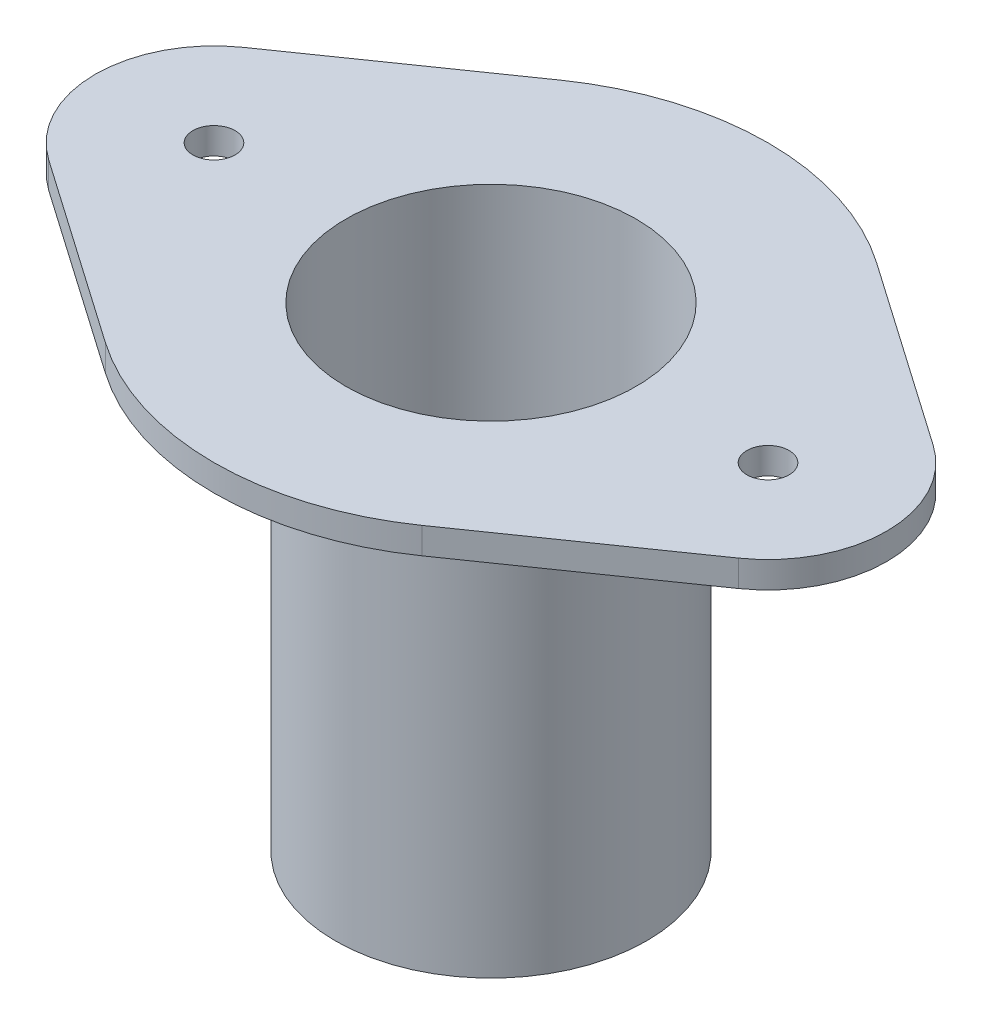
ISO-10303-21;
HEADER;
FILE_DESCRIPTION(('STEP AP214'),'2;1');
FILE_NAME('part.step','',(''),(''),'','','');
FILE_SCHEMA(('AUTOMOTIVE_DESIGN { 1 0 10303 214 1 1 1 1 }'));
ENDSEC;
DATA;
#1=APPLICATION_CONTEXT('core data for automotive mechanical design processes');
#2=APPLICATION_PROTOCOL_DEFINITION('international standard','automotive_design',2000,#1);
#3=PRODUCT_CONTEXT('',#1,'mechanical');
#4=PRODUCT('Part','Part','',(#3));
#5=PRODUCT_RELATED_PRODUCT_CATEGORY('part','',(#4));
#6=PRODUCT_DEFINITION_FORMATION('','',#4);
#7=PRODUCT_DEFINITION_CONTEXT('part definition',#1,'design');
#8=PRODUCT_DEFINITION('design','',#6,#7);
#9=PRODUCT_DEFINITION_SHAPE('','',#8);
#10=(LENGTH_UNIT() NAMED_UNIT(*) SI_UNIT(.MILLI.,.METRE.));
#11=(NAMED_UNIT(*) PLANE_ANGLE_UNIT() SI_UNIT($,.RADIAN.));
#12=(NAMED_UNIT(*) SI_UNIT($,.STERADIAN.) SOLID_ANGLE_UNIT());
#13=UNCERTAINTY_MEASURE_WITH_UNIT(LENGTH_MEASURE(1.E-05),#10,'distance_accuracy_value','');
#14=(GEOMETRIC_REPRESENTATION_CONTEXT(3) GLOBAL_UNCERTAINTY_ASSIGNED_CONTEXT((#13)) GLOBAL_UNIT_ASSIGNED_CONTEXT((#10,
#11,#12)) REPRESENTATION_CONTEXT('',''));
#15=CARTESIAN_POINT('',(0.,0.,0.));
#16=DIRECTION('',(0.,0.,1.));
#17=DIRECTION('',(1.,0.,0.));
#18=AXIS2_PLACEMENT_3D('',#15,#16,#17);
#19=CARTESIAN_POINT('',(0.,0.,0.));
#20=DIRECTION('',(0.,1.,0.));
#21=DIRECTION('',(0.,0.,1.));
#22=AXIS2_PLACEMENT_3D('',#19,#20,#21);
#23=PLANE('',#22);
#24=CARTESIAN_POINT('',(0.,0.,0.));
#25=DIRECTION('',(0.,1.,0.));
#26=DIRECTION('',(0.,0.,1.));
#27=AXIS2_PLACEMENT_3D('',#24,#25,#26);
#28=CIRCLE('',#27,29.5);
#29=CARTESIAN_POINT('',(0.,0.,29.5));
#30=VERTEX_POINT('',#29);
#31=EDGE_CURVE('E37',#30,#30,#28,.T.);
#32=ORIENTED_EDGE('',*,*,#31,.F.);
#33=EDGE_LOOP('',(#32));
#34=FACE_BOUND('',#33,.T.);
#35=CARTESIAN_POINT('',(0.,0.,0.));
#36=DIRECTION('',(0.,1.,0.));
#37=DIRECTION('',(0.,0.,1.));
#38=AXIS2_PLACEMENT_3D('',#35,#36,#37);
#39=CIRCLE('',#38,27.5);
#40=CARTESIAN_POINT('',(0.,0.,27.5));
#41=VERTEX_POINT('',#40);
#42=EDGE_CURVE('E162',#41,#41,#39,.T.);
#43=ORIENTED_EDGE('',*,*,#42,.T.);
#44=EDGE_LOOP('',(#43));
#45=FACE_BOUND('',#44,.T.);
#46=ADVANCED_FACE('F33',(#34,#45),#23,.F.);
#47=CARTESIAN_POINT('',(0.,85.,0.));
#48=DIRECTION('',(0.,-1.,0.));
#49=DIRECTION('',(0.,0.,-1.));
#50=AXIS2_PLACEMENT_3D('',#47,#48,#49);
#51=CYLINDRICAL_SURFACE('',#50,29.5);
#52=CARTESIAN_POINT('',(0.,85.,0.));
#53=DIRECTION('',(0.,1.,0.));
#54=DIRECTION('',(0.,0.,1.));
#55=AXIS2_PLACEMENT_3D('',#52,#53,#54);
#56=CIRCLE('',#55,29.5);
#57=CARTESIAN_POINT('',(0.,85.,29.5));
#58=VERTEX_POINT('',#57);
#59=EDGE_CURVE('E11',#58,#58,#56,.T.);
#60=ORIENTED_EDGE('',*,*,#59,.F.);
#61=EDGE_LOOP('',(#60));
#62=FACE_BOUND('',#61,.T.);
#63=ORIENTED_EDGE('',*,*,#31,.T.);
#64=EDGE_LOOP('',(#63));
#65=FACE_BOUND('',#64,.T.);
#66=ADVANCED_FACE('F35',(#62,#65),#51,.T.);
#67=CARTESIAN_POINT('',(0.,85.,0.));
#68=DIRECTION('',(0.,-1.,0.));
#69=DIRECTION('',(0.,0.,-1.));
#70=AXIS2_PLACEMENT_3D('',#67,#68,#69);
#71=CYLINDRICAL_SURFACE('',#70,27.5);
#72=ORIENTED_EDGE('',*,*,#42,.F.);
#73=EDGE_LOOP('',(#72));
#74=FACE_BOUND('',#73,.T.);
#75=CARTESIAN_POINT('',(0.,90.,0.));
#76=DIRECTION('',(0.,1.,0.));
#77=DIRECTION('',(0.,0.,1.));
#78=AXIS2_PLACEMENT_3D('',#75,#76,#77);
#79=CIRCLE('',#78,27.5);
#80=CARTESIAN_POINT('',(0.,90.,27.5));
#81=VERTEX_POINT('',#80);
#82=EDGE_CURVE('E230',#81,#81,#79,.T.);
#83=ORIENTED_EDGE('',*,*,#82,.T.);
#84=EDGE_LOOP('',(#83));
#85=FACE_BOUND('',#84,.T.);
#86=ADVANCED_FACE('F174',(#74,#85),#71,.F.);
#87=CARTESIAN_POINT('',(0.,90.,0.));
#88=DIRECTION('',(0.,1.,0.));
#89=DIRECTION('',(0.,0.,1.));
#90=AXIS2_PLACEMENT_3D('',#87,#88,#89);
#91=PLANE('',#90);
#92=CARTESIAN_POINT('',(-52.5,90.,0.));
#93=DIRECTION('',(0.,1.,0.));
#94=DIRECTION('',(0.,0.,1.));
#95=AXIS2_PLACEMENT_3D('',#92,#93,#94);
#96=CIRCLE('',#95,4.00000000000001);
#97=CARTESIAN_POINT('',(-52.5,90.,4.00000000000001));
#98=VERTEX_POINT('',#97);
#99=EDGE_CURVE('E225',#98,#98,#96,.T.);
#100=ORIENTED_EDGE('',*,*,#99,.F.);
#101=EDGE_LOOP('',(#100));
#102=FACE_BOUND('',#101,.T.);
#103=CARTESIAN_POINT('',(0.,90.,0.));
#104=DIRECTION('',(0.,1.,0.));
#105=DIRECTION('',(0.,0.,1.));
#106=AXIS2_PLACEMENT_3D('',#103,#104,#105);
#107=CIRCLE('',#106,52.5);
#108=CARTESIAN_POINT('',(30.,90.,-43.0842198490352));
#109=VERTEX_POINT('',#108);
#110=CARTESIAN_POINT('',(-30.,90.,-43.0842198490352));
#111=VERTEX_POINT('',#110);
#112=EDGE_CURVE('E147',#109,#111,#107,.T.);
#113=ORIENTED_EDGE('',*,*,#112,.T.);
#114=DIRECTION('',(-0.82065180664829,0.,0.571428571428571));
#115=VECTOR('',#114,1.);
#116=CARTESIAN_POINT('',(-65.3571428571428,90.,-18.4646656495865));
#117=LINE('',#116,#115);
#118=CARTESIAN_POINT('',(-65.3571428571428,90.,-18.4646656495865));
#119=VERTEX_POINT('',#118);
#120=EDGE_CURVE('E94',#111,#119,#117,.T.);
#121=ORIENTED_EDGE('',*,*,#120,.T.);
#122=CARTESIAN_POINT('',(-52.5,90.,0.));
#123=DIRECTION('',(0.,1.,0.));
#124=DIRECTION('',(0.,0.,1.));
#125=AXIS2_PLACEMENT_3D('',#122,#123,#124);
#126=CIRCLE('',#125,22.5);
#127=CARTESIAN_POINT('',(-65.3571428571428,90.,18.4646656495865));
#128=VERTEX_POINT('',#127);
#129=EDGE_CURVE('E243',#119,#128,#126,.T.);
#130=ORIENTED_EDGE('',*,*,#129,.T.);
#131=DIRECTION('',(0.82065180664829,0.,0.571428571428571));
#132=VECTOR('',#131,1.);
#133=CARTESIAN_POINT('',(-65.3571428571428,90.,18.4646656495865));
#134=LINE('',#133,#132);
#135=CARTESIAN_POINT('',(-30.,90.,43.0842198490352));
#136=VERTEX_POINT('',#135);
#137=EDGE_CURVE('E245',#128,#136,#134,.T.);
#138=ORIENTED_EDGE('',*,*,#137,.T.);
#139=CARTESIAN_POINT('',(0.,90.,0.));
#140=DIRECTION('',(0.,1.,0.));
#141=DIRECTION('',(0.,0.,1.));
#142=AXIS2_PLACEMENT_3D('',#139,#140,#141);
#143=CIRCLE('',#142,52.5);
#144=CARTESIAN_POINT('',(30.,90.,43.0842198490352));
#145=VERTEX_POINT('',#144);
#146=EDGE_CURVE('E114',#136,#145,#143,.T.);
#147=ORIENTED_EDGE('',*,*,#146,.T.);
#148=DIRECTION('',(0.82065180664829,0.,-0.571428571428571));
#149=VECTOR('',#148,1.);
#150=CARTESIAN_POINT('',(65.3571428571428,90.,18.4646656495865));
#151=LINE('',#150,#149);
#152=CARTESIAN_POINT('',(65.3571428571428,90.,18.4646656495865));
#153=VERTEX_POINT('',#152);
#154=EDGE_CURVE('E107',#145,#153,#151,.T.);
#155=ORIENTED_EDGE('',*,*,#154,.T.);
#156=CARTESIAN_POINT('',(52.5,90.,0.));
#157=DIRECTION('',(0.,1.,0.));
#158=DIRECTION('',(0.,0.,1.));
#159=AXIS2_PLACEMENT_3D('',#156,#157,#158);
#160=CIRCLE('',#159,22.5);
#161=CARTESIAN_POINT('',(65.3571428571428,90.,-18.4646656495865));
#162=VERTEX_POINT('',#161);
#163=EDGE_CURVE('E112',#153,#162,#160,.T.);
#164=ORIENTED_EDGE('',*,*,#163,.T.);
#165=DIRECTION('',(-0.82065180664829,0.,-0.571428571428571));
#166=VECTOR('',#165,1.);
#167=CARTESIAN_POINT('',(30.,90.,-43.0842198490352));
#168=LINE('',#167,#166);
#169=EDGE_CURVE('E50',#162,#109,#168,.T.);
#170=ORIENTED_EDGE('',*,*,#169,.T.);
#171=EDGE_LOOP('',(#113,#121,#130,#138,#147,#155,#164,#170));
#172=FACE_BOUND('',#171,.T.);
#173=CARTESIAN_POINT('',(52.5,90.,0.));
#174=DIRECTION('',(0.,1.,0.));
#175=DIRECTION('',(0.,0.,1.));
#176=AXIS2_PLACEMENT_3D('',#173,#174,#175);
#177=CIRCLE('',#176,4.00000000000001);
#178=CARTESIAN_POINT('',(52.5,90.,4.00000000000001));
#179=VERTEX_POINT('',#178);
#180=EDGE_CURVE('E136',#179,#179,#177,.T.);
#181=ORIENTED_EDGE('',*,*,#180,.F.);
#182=EDGE_LOOP('',(#181));
#183=FACE_BOUND('',#182,.T.);
#184=ORIENTED_EDGE('',*,*,#82,.F.);
#185=EDGE_LOOP('',(#184));
#186=FACE_BOUND('',#185,.T.);
#187=ADVANCED_FACE('F109',(#102,#172,#183,#186),#91,.T.);
#188=CARTESIAN_POINT('',(0.,85.,0.));
#189=DIRECTION('',(0.,1.,0.));
#190=DIRECTION('',(0.,0.,1.));
#191=AXIS2_PLACEMENT_3D('',#188,#189,#190);
#192=PLANE('',#191);
#193=ORIENTED_EDGE('',*,*,#59,.T.);
#194=EDGE_LOOP('',(#193));
#195=FACE_BOUND('',#194,.T.);
#196=CARTESIAN_POINT('',(0.,85.,0.));
#197=DIRECTION('',(0.,1.,0.));
#198=DIRECTION('',(0.,0.,1.));
#199=AXIS2_PLACEMENT_3D('',#196,#197,#198);
#200=CIRCLE('',#199,52.5);
#201=CARTESIAN_POINT('',(30.,85.,-43.0842198490352));
#202=VERTEX_POINT('',#201);
#203=CARTESIAN_POINT('',(-30.,85.,-43.0842198490352));
#204=VERTEX_POINT('',#203);
#205=EDGE_CURVE('E132',#202,#204,#200,.T.);
#206=ORIENTED_EDGE('',*,*,#205,.F.);
#207=DIRECTION('',(-0.82065180664829,0.,-0.571428571428571));
#208=VECTOR('',#207,1.);
#209=CARTESIAN_POINT('',(30.,85.,-43.0842198490352));
#210=LINE('',#209,#208);
#211=CARTESIAN_POINT('',(65.3571428571428,85.,-18.4646656495865));
#212=VERTEX_POINT('',#211);
#213=EDGE_CURVE('E85',#212,#202,#210,.T.);
#214=ORIENTED_EDGE('',*,*,#213,.F.);
#215=CARTESIAN_POINT('',(52.5,85.,0.));
#216=DIRECTION('',(0.,1.,0.));
#217=DIRECTION('',(0.,0.,1.));
#218=AXIS2_PLACEMENT_3D('',#215,#216,#217);
#219=CIRCLE('',#218,22.5);
#220=CARTESIAN_POINT('',(65.3571428571428,85.,18.4646656495865));
#221=VERTEX_POINT('',#220);
#222=EDGE_CURVE('E79',#221,#212,#219,.T.);
#223=ORIENTED_EDGE('',*,*,#222,.F.);
#224=DIRECTION('',(0.82065180664829,0.,-0.571428571428571));
#225=VECTOR('',#224,1.);
#226=CARTESIAN_POINT('',(65.3571428571428,85.,18.4646656495865));
#227=LINE('',#226,#225);
#228=CARTESIAN_POINT('',(30.,85.,43.0842198490352));
#229=VERTEX_POINT('',#228);
#230=EDGE_CURVE('E122',#229,#221,#227,.T.);
#231=ORIENTED_EDGE('',*,*,#230,.F.);
#232=CARTESIAN_POINT('',(0.,85.,0.));
#233=DIRECTION('',(0.,1.,0.));
#234=DIRECTION('',(0.,0.,1.));
#235=AXIS2_PLACEMENT_3D('',#232,#233,#234);
#236=CIRCLE('',#235,52.5);
#237=CARTESIAN_POINT('',(-30.,85.,43.0842198490352));
#238=VERTEX_POINT('',#237);
#239=EDGE_CURVE('E142',#238,#229,#236,.T.);
#240=ORIENTED_EDGE('',*,*,#239,.F.);
#241=DIRECTION('',(0.82065180664829,0.,0.571428571428571));
#242=VECTOR('',#241,1.);
#243=CARTESIAN_POINT('',(-65.3571428571428,85.,18.4646656495865));
#244=LINE('',#243,#242);
#245=CARTESIAN_POINT('',(-65.3571428571428,85.,18.4646656495865));
#246=VERTEX_POINT('',#245);
#247=EDGE_CURVE('E140',#246,#238,#244,.T.);
#248=ORIENTED_EDGE('',*,*,#247,.F.);
#249=CARTESIAN_POINT('',(-52.5,85.,0.));
#250=DIRECTION('',(0.,1.,0.));
#251=DIRECTION('',(0.,0.,1.));
#252=AXIS2_PLACEMENT_3D('',#249,#250,#251);
#253=CIRCLE('',#252,22.5);
#254=CARTESIAN_POINT('',(-65.3571428571428,85.,-18.4646656495865));
#255=VERTEX_POINT('',#254);
#256=EDGE_CURVE('E138',#255,#246,#253,.T.);
#257=ORIENTED_EDGE('',*,*,#256,.F.);
#258=DIRECTION('',(-0.82065180664829,0.,0.571428571428571));
#259=VECTOR('',#258,1.);
#260=CARTESIAN_POINT('',(-65.3571428571428,85.,-18.4646656495865));
#261=LINE('',#260,#259);
#262=EDGE_CURVE('E135',#204,#255,#261,.T.);
#263=ORIENTED_EDGE('',*,*,#262,.F.);
#264=EDGE_LOOP('',(#206,#214,#223,#231,#240,#248,#257,#263));
#265=FACE_BOUND('',#264,.T.);
#266=CARTESIAN_POINT('',(52.5,85.,0.));
#267=DIRECTION('',(0.,1.,0.));
#268=DIRECTION('',(0.,0.,1.));
#269=AXIS2_PLACEMENT_3D('',#266,#267,#268);
#270=CIRCLE('',#269,4.00000000000001);
#271=CARTESIAN_POINT('',(52.5,85.,4.00000000000001));
#272=VERTEX_POINT('',#271);
#273=EDGE_CURVE('E232',#272,#272,#270,.T.);
#274=ORIENTED_EDGE('',*,*,#273,.T.);
#275=EDGE_LOOP('',(#274));
#276=FACE_BOUND('',#275,.T.);
#277=CARTESIAN_POINT('',(-52.5,85.,0.));
#278=DIRECTION('',(0.,1.,0.));
#279=DIRECTION('',(0.,0.,1.));
#280=AXIS2_PLACEMENT_3D('',#277,#278,#279);
#281=CIRCLE('',#280,4.00000000000001);
#282=CARTESIAN_POINT('',(-52.5,85.,4.00000000000001));
#283=VERTEX_POINT('',#282);
#284=EDGE_CURVE('E228',#283,#283,#281,.T.);
#285=ORIENTED_EDGE('',*,*,#284,.T.);
#286=EDGE_LOOP('',(#285));
#287=FACE_BOUND('',#286,.T.);
#288=ADVANCED_FACE('F184',(#195,#265,#276,#287),#192,.F.);
#289=CARTESIAN_POINT('',(0.,90.,0.));
#290=DIRECTION('',(0.,-1.,0.));
#291=DIRECTION('',(0.,0.,-1.));
#292=AXIS2_PLACEMENT_3D('',#289,#290,#291);
#293=CYLINDRICAL_SURFACE('',#292,52.5);
#294=ORIENTED_EDGE('',*,*,#205,.T.);
#295=DIRECTION('',(0.,-1.,0.));
#296=VECTOR('',#295,1.);
#297=CARTESIAN_POINT('',(-30.,90.,-43.0842198490352));
#298=LINE('',#297,#296);
#299=EDGE_CURVE('E160',#111,#204,#298,.T.);
#300=ORIENTED_EDGE('',*,*,#299,.F.);
#301=ORIENTED_EDGE('',*,*,#112,.F.);
#302=DIRECTION('',(0.,-1.,0.));
#303=VECTOR('',#302,1.);
#304=CARTESIAN_POINT('',(30.,90.,-43.0842198490352));
#305=LINE('',#304,#303);
#306=EDGE_CURVE('E128',#109,#202,#305,.T.);
#307=ORIENTED_EDGE('',*,*,#306,.T.);
#308=EDGE_LOOP('',(#294,#300,#301,#307));
#309=FACE_BOUND('',#308,.T.);
#310=ADVANCED_FACE('F180',(#309),#293,.T.);
#311=CARTESIAN_POINT('',(-65.3571428571428,90.,-18.4646656495865));
#312=DIRECTION('',(0.571428571428572,0.,0.82065180664829));
#313=DIRECTION('',(0.82065180664829,0.,-0.571428571428572));
#314=AXIS2_PLACEMENT_3D('',#311,#312,#313);
#315=PLANE('',#314);
#316=ORIENTED_EDGE('',*,*,#262,.T.);
#317=DIRECTION('',(0.,-1.,0.));
#318=VECTOR('',#317,1.);
#319=CARTESIAN_POINT('',(-65.3571428571428,90.,-18.4646656495865));
#320=LINE('',#319,#318);
#321=EDGE_CURVE('E157',#119,#255,#320,.T.);
#322=ORIENTED_EDGE('',*,*,#321,.F.);
#323=ORIENTED_EDGE('',*,*,#120,.F.);
#324=ORIENTED_EDGE('',*,*,#299,.T.);
#325=EDGE_LOOP('',(#316,#322,#323,#324));
#326=FACE_BOUND('',#325,.T.);
#327=ADVANCED_FACE('F183',(#326),#315,.F.);
#328=CARTESIAN_POINT('',(-52.5,90.,0.));
#329=DIRECTION('',(0.,-1.,0.));
#330=DIRECTION('',(0.,0.,-1.));
#331=AXIS2_PLACEMENT_3D('',#328,#329,#330);
#332=CYLINDRICAL_SURFACE('',#331,22.5);
#333=ORIENTED_EDGE('',*,*,#256,.T.);
#334=DIRECTION('',(0.,-1.,0.));
#335=VECTOR('',#334,1.);
#336=CARTESIAN_POINT('',(-65.3571428571428,90.,18.4646656495865));
#337=LINE('',#336,#335);
#338=EDGE_CURVE('E154',#128,#246,#337,.T.);
#339=ORIENTED_EDGE('',*,*,#338,.F.);
#340=ORIENTED_EDGE('',*,*,#129,.F.);
#341=ORIENTED_EDGE('',*,*,#321,.T.);
#342=EDGE_LOOP('',(#333,#339,#340,#341));
#343=FACE_BOUND('',#342,.T.);
#344=ADVANCED_FACE('F188',(#343),#332,.T.);
#345=CARTESIAN_POINT('',(-65.3571428571428,90.,18.4646656495865));
#346=DIRECTION('',(0.571428571428571,0.,-0.82065180664829));
#347=DIRECTION('',(-0.82065180664829,0.,-0.571428571428571));
#348=AXIS2_PLACEMENT_3D('',#345,#346,#347);
#349=PLANE('',#348);
#350=ORIENTED_EDGE('',*,*,#247,.T.);
#351=DIRECTION('',(0.,-1.,0.));
#352=VECTOR('',#351,1.);
#353=CARTESIAN_POINT('',(-30.,90.,43.0842198490352));
#354=LINE('',#353,#352);
#355=EDGE_CURVE('E151',#136,#238,#354,.T.);
#356=ORIENTED_EDGE('',*,*,#355,.F.);
#357=ORIENTED_EDGE('',*,*,#137,.F.);
#358=ORIENTED_EDGE('',*,*,#338,.T.);
#359=EDGE_LOOP('',(#350,#356,#357,#358));
#360=FACE_BOUND('',#359,.T.);
#361=ADVANCED_FACE('F191',(#360),#349,.F.);
#362=CARTESIAN_POINT('',(0.,90.,0.));
#363=DIRECTION('',(0.,-1.,0.));
#364=DIRECTION('',(0.,0.,-1.));
#365=AXIS2_PLACEMENT_3D('',#362,#363,#364);
#366=CYLINDRICAL_SURFACE('',#365,52.5);
#367=ORIENTED_EDGE('',*,*,#239,.T.);
#368=DIRECTION('',(0.,-1.,0.));
#369=VECTOR('',#368,1.);
#370=CARTESIAN_POINT('',(30.,90.,43.0842198490352));
#371=LINE('',#370,#369);
#372=EDGE_CURVE('E123',#145,#229,#371,.T.);
#373=ORIENTED_EDGE('',*,*,#372,.F.);
#374=ORIENTED_EDGE('',*,*,#146,.F.);
#375=ORIENTED_EDGE('',*,*,#355,.T.);
#376=EDGE_LOOP('',(#367,#373,#374,#375));
#377=FACE_BOUND('',#376,.T.);
#378=ADVANCED_FACE('F195',(#377),#366,.T.);
#379=CARTESIAN_POINT('',(65.3571428571428,90.,18.4646656495865));
#380=DIRECTION('',(-0.571428571428571,0.,-0.82065180664829));
#381=DIRECTION('',(-0.82065180664829,0.,0.571428571428571));
#382=AXIS2_PLACEMENT_3D('',#379,#380,#381);
#383=PLANE('',#382);
#384=ORIENTED_EDGE('',*,*,#230,.T.);
#385=DIRECTION('',(0.,-1.,0.));
#386=VECTOR('',#385,1.);
#387=CARTESIAN_POINT('',(65.3571428571428,90.,18.4646656495865));
#388=LINE('',#387,#386);
#389=EDGE_CURVE('E119',#153,#221,#388,.T.);
#390=ORIENTED_EDGE('',*,*,#389,.F.);
#391=ORIENTED_EDGE('',*,*,#154,.F.);
#392=ORIENTED_EDGE('',*,*,#372,.T.);
#393=EDGE_LOOP('',(#384,#390,#391,#392));
#394=FACE_BOUND('',#393,.T.);
#395=ADVANCED_FACE('F120',(#394),#383,.F.);
#396=CARTESIAN_POINT('',(52.5,90.,0.));
#397=DIRECTION('',(0.,-1.,0.));
#398=DIRECTION('',(0.,0.,-1.));
#399=AXIS2_PLACEMENT_3D('',#396,#397,#398);
#400=CYLINDRICAL_SURFACE('',#399,22.5);
#401=ORIENTED_EDGE('',*,*,#222,.T.);
#402=DIRECTION('',(0.,-1.,0.));
#403=VECTOR('',#402,1.);
#404=CARTESIAN_POINT('',(65.3571428571428,90.,-18.4646656495865));
#405=LINE('',#404,#403);
#406=EDGE_CURVE('E124',#162,#212,#405,.T.);
#407=ORIENTED_EDGE('',*,*,#406,.F.);
#408=ORIENTED_EDGE('',*,*,#163,.F.);
#409=ORIENTED_EDGE('',*,*,#389,.T.);
#410=EDGE_LOOP('',(#401,#407,#408,#409));
#411=FACE_BOUND('',#410,.T.);
#412=ADVANCED_FACE('F126',(#411),#400,.T.);
#413=CARTESIAN_POINT('',(30.,90.,-43.0842198490352));
#414=DIRECTION('',(-0.571428571428571,0.,0.82065180664829));
#415=DIRECTION('',(0.82065180664829,0.,0.571428571428571));
#416=AXIS2_PLACEMENT_3D('',#413,#414,#415);
#417=PLANE('',#416);
#418=ORIENTED_EDGE('',*,*,#213,.T.);
#419=ORIENTED_EDGE('',*,*,#306,.F.);
#420=ORIENTED_EDGE('',*,*,#169,.F.);
#421=ORIENTED_EDGE('',*,*,#406,.T.);
#422=EDGE_LOOP('',(#418,#419,#420,#421));
#423=FACE_BOUND('',#422,.T.);
#424=ADVANCED_FACE('F204',(#423),#417,.F.);
#425=CARTESIAN_POINT('',(52.5,90.,0.));
#426=DIRECTION('',(0.,-1.,0.));
#427=DIRECTION('',(0.,0.,-1.));
#428=AXIS2_PLACEMENT_3D('',#425,#426,#427);
#429=CYLINDRICAL_SURFACE('',#428,4.00000000000001);
#430=ORIENTED_EDGE('',*,*,#180,.T.);
#431=EDGE_LOOP('',(#430));
#432=FACE_BOUND('',#431,.T.);
#433=ORIENTED_EDGE('',*,*,#273,.F.);
#434=EDGE_LOOP('',(#433));
#435=FACE_BOUND('',#434,.T.);
#436=ADVANCED_FACE('F207',(#432,#435),#429,.F.);
#437=CARTESIAN_POINT('',(-52.5,90.,0.));
#438=DIRECTION('',(0.,-1.,0.));
#439=DIRECTION('',(0.,0.,-1.));
#440=AXIS2_PLACEMENT_3D('',#437,#438,#439);
#441=CYLINDRICAL_SURFACE('',#440,4.00000000000001);
#442=ORIENTED_EDGE('',*,*,#99,.T.);
#443=EDGE_LOOP('',(#442));
#444=FACE_BOUND('',#443,.T.);
#445=ORIENTED_EDGE('',*,*,#284,.F.);
#446=EDGE_LOOP('',(#445));
#447=FACE_BOUND('',#446,.T.);
#448=ADVANCED_FACE('F216',(#444,#447),#441,.F.);
#449=CLOSED_SHELL('',(#46,#66,#86,#187,#288,#310,#327,#344,#361,#378,#395,#412,#424,#436,#448));
#450=MANIFOLD_SOLID_BREP('B2',#449);
#451=ADVANCED_BREP_SHAPE_REPRESENTATION('',(#18,#450),#14);
#452=SHAPE_DEFINITION_REPRESENTATION(#9,#451);
ENDSEC;
END-ISO-10303-21;
